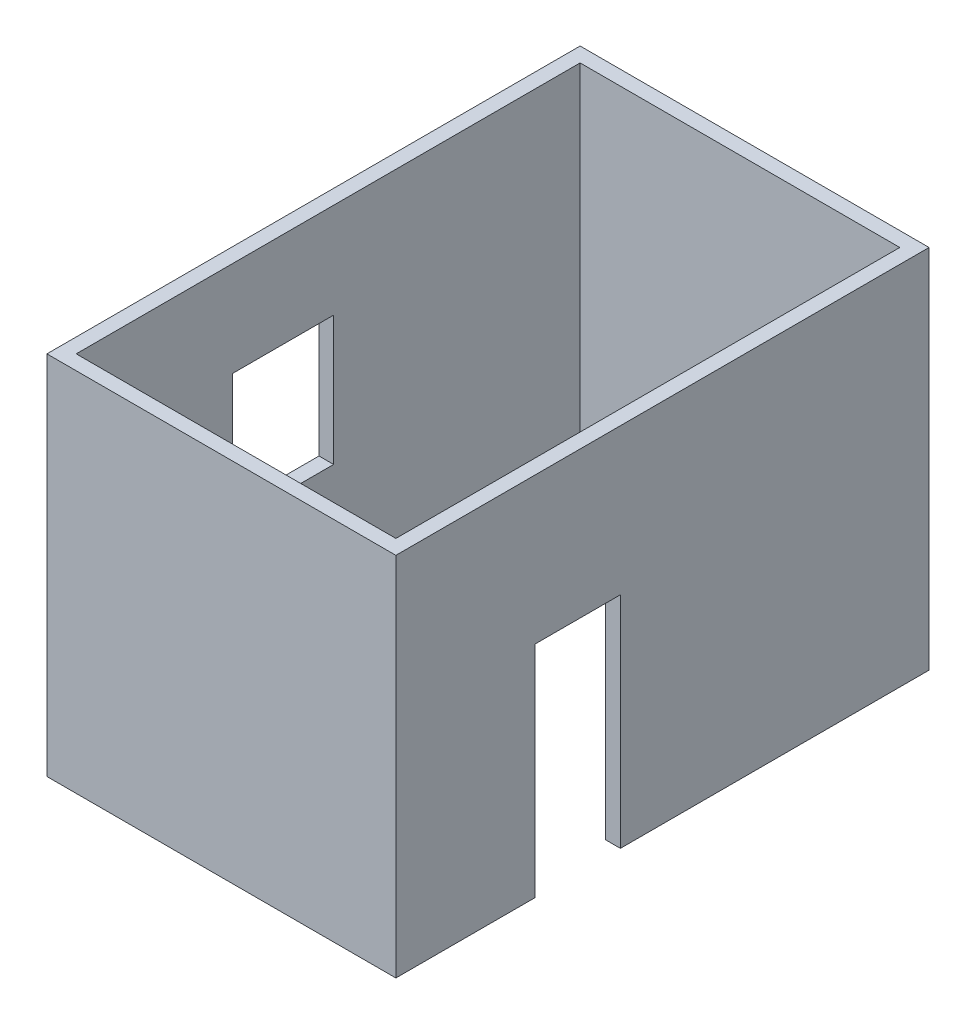
ISO-10303-21;
HEADER;
FILE_DESCRIPTION(('STEP AP214'),'2;1');
FILE_NAME('part.step','',(''),(''),'','','');
FILE_SCHEMA(('AUTOMOTIVE_DESIGN { 1 0 10303 214 1 1 1 1 }'));
ENDSEC;
DATA;
#1=APPLICATION_CONTEXT('core data for automotive mechanical design processes');
#2=APPLICATION_PROTOCOL_DEFINITION('international standard','automotive_design',2000,#1);
#3=PRODUCT_CONTEXT('',#1,'mechanical');
#4=PRODUCT('Part','Part','',(#3));
#5=PRODUCT_RELATED_PRODUCT_CATEGORY('part','',(#4));
#6=PRODUCT_DEFINITION_FORMATION('','',#4);
#7=PRODUCT_DEFINITION_CONTEXT('part definition',#1,'design');
#8=PRODUCT_DEFINITION('design','',#6,#7);
#9=PRODUCT_DEFINITION_SHAPE('','',#8);
#10=(LENGTH_UNIT() NAMED_UNIT(*) SI_UNIT(.MILLI.,.METRE.));
#11=(NAMED_UNIT(*) PLANE_ANGLE_UNIT() SI_UNIT($,.RADIAN.));
#12=(NAMED_UNIT(*) SI_UNIT($,.STERADIAN.) SOLID_ANGLE_UNIT());
#13=UNCERTAINTY_MEASURE_WITH_UNIT(LENGTH_MEASURE(1.E-05),#10,'distance_accuracy_value','');
#14=(GEOMETRIC_REPRESENTATION_CONTEXT(3) GLOBAL_UNCERTAINTY_ASSIGNED_CONTEXT((#13)) GLOBAL_UNIT_ASSIGNED_CONTEXT((#10,
#11,#12)) REPRESENTATION_CONTEXT('',''));
#15=CARTESIAN_POINT('',(0.,0.,0.));
#16=DIRECTION('',(0.,0.,1.));
#17=DIRECTION('',(1.,0.,0.));
#18=AXIS2_PLACEMENT_3D('',#15,#16,#17);
#19=CARTESIAN_POINT('',(0.,3000.,0.));
#20=DIRECTION('',(0.,1.,0.));
#21=DIRECTION('',(0.,0.,1.));
#22=AXIS2_PLACEMENT_3D('',#19,#20,#21);
#23=PLANE('',#22);
#24=DIRECTION('',(0.,0.,-1.));
#25=VECTOR('',#24,1.);
#26=CARTESIAN_POINT('',(120.,3000.,0.));
#27=LINE('',#26,#25);
#28=CARTESIAN_POINT('',(120.,3000.,120.));
#29=VERTEX_POINT('',#28);
#30=CARTESIAN_POINT('',(120.,3000.,-4250.));
#31=VERTEX_POINT('',#30);
#32=EDGE_CURVE('E267',#29,#31,#27,.T.);
#33=ORIENTED_EDGE('',*,*,#32,.T.);
#34=DIRECTION('',(-1.,0.,0.));
#35=VECTOR('',#34,1.);
#36=CARTESIAN_POINT('',(0.,3000.,-4250.));
#37=LINE('',#36,#35);
#38=CARTESIAN_POINT('',(-2740.,3000.,-4250.));
#39=VERTEX_POINT('',#38);
#40=EDGE_CURVE('E270',#31,#39,#37,.T.);
#41=ORIENTED_EDGE('',*,*,#40,.T.);
#42=DIRECTION('',(0.,0.,1.));
#43=VECTOR('',#42,1.);
#44=CARTESIAN_POINT('',(-2740.,3000.,3.20857461376607E-13));
#45=LINE('',#44,#43);
#46=CARTESIAN_POINT('',(-2740.,3000.,120.));
#47=VERTEX_POINT('',#46);
#48=EDGE_CURVE('E273',#39,#47,#45,.T.);
#49=ORIENTED_EDGE('',*,*,#48,.T.);
#50=DIRECTION('',(1.,0.,0.));
#51=VECTOR('',#50,1.);
#52=CARTESIAN_POINT('',(0.,3000.,120.));
#53=LINE('',#52,#51);
#54=EDGE_CURVE('E275',#47,#29,#53,.T.);
#55=ORIENTED_EDGE('',*,*,#54,.T.);
#56=EDGE_LOOP('',(#33,#41,#49,#55));
#57=FACE_BOUND('',#56,.T.);
#58=DIRECTION('',(-1.,0.,0.));
#59=VECTOR('',#58,1.);
#60=CARTESIAN_POINT('',(0.,3000.,-4130.));
#61=LINE('',#60,#59);
#62=CARTESIAN_POINT('',(0.,3000.,-4130.));
#63=VERTEX_POINT('',#62);
#64=CARTESIAN_POINT('',(-2620.,3000.,-4130.));
#65=VERTEX_POINT('',#64);
#66=EDGE_CURVE('E237',#63,#65,#61,.T.);
#67=ORIENTED_EDGE('',*,*,#66,.F.);
#68=DIRECTION('',(0.,0.,-1.));
#69=VECTOR('',#68,1.);
#70=CARTESIAN_POINT('',(0.,3000.,0.));
#71=LINE('',#70,#69);
#72=CARTESIAN_POINT('',(0.,3000.,0.));
#73=VERTEX_POINT('',#72);
#74=EDGE_CURVE('E235',#73,#63,#71,.T.);
#75=ORIENTED_EDGE('',*,*,#74,.F.);
#76=DIRECTION('',(1.,0.,0.));
#77=VECTOR('',#76,1.);
#78=CARTESIAN_POINT('',(0.,3000.,0.));
#79=LINE('',#78,#77);
#80=CARTESIAN_POINT('',(-2620.,3000.,3.20857461376606E-13));
#81=VERTEX_POINT('',#80);
#82=EDGE_CURVE('E243',#81,#73,#79,.T.);
#83=ORIENTED_EDGE('',*,*,#82,.F.);
#84=DIRECTION('',(0.,0.,1.));
#85=VECTOR('',#84,1.);
#86=CARTESIAN_POINT('',(-2620.,3000.,3.20857461376607E-13));
#87=LINE('',#86,#85);
#88=EDGE_CURVE('E240',#65,#81,#87,.T.);
#89=ORIENTED_EDGE('',*,*,#88,.F.);
#90=EDGE_LOOP('',(#67,#75,#83,#89));
#91=FACE_BOUND('',#90,.T.);
#92=ADVANCED_FACE('F59',(#57,#91),#23,.T.);
#93=CARTESIAN_POINT('',(0.,0.,0.));
#94=DIRECTION('',(0.,1.,0.));
#95=DIRECTION('',(0.,0.,1.));
#96=AXIS2_PLACEMENT_3D('',#93,#94,#95);
#97=PLANE('',#96);
#98=DIRECTION('',(0.,0.,-1.));
#99=VECTOR('',#98,1.);
#100=CARTESIAN_POINT('',(0.,0.,0.));
#101=LINE('',#100,#99);
#102=CARTESIAN_POINT('',(0.,0.,0.));
#103=VERTEX_POINT('',#102);
#104=CARTESIAN_POINT('',(0.,0.,-1020.));
#105=VERTEX_POINT('',#104);
#106=EDGE_CURVE('E246',#103,#105,#101,.T.);
#107=ORIENTED_EDGE('',*,*,#106,.T.);
#108=DIRECTION('',(1.,0.,0.));
#109=VECTOR('',#108,1.);
#110=CARTESIAN_POINT('',(-2740.001,0.,-1020.));
#111=LINE('',#110,#109);
#112=CARTESIAN_POINT('',(120.,0.,-1020.));
#113=VERTEX_POINT('',#112);
#114=EDGE_CURVE('E221',#105,#113,#111,.T.);
#115=ORIENTED_EDGE('',*,*,#114,.T.);
#116=DIRECTION('',(0.,0.,-1.));
#117=VECTOR('',#116,1.);
#118=CARTESIAN_POINT('',(120.,0.,0.));
#119=LINE('',#118,#117);
#120=CARTESIAN_POINT('',(120.,0.,120.));
#121=VERTEX_POINT('',#120);
#122=EDGE_CURVE('E278',#121,#113,#119,.T.);
#123=ORIENTED_EDGE('',*,*,#122,.F.);
#124=DIRECTION('',(1.,0.,0.));
#125=VECTOR('',#124,1.);
#126=CARTESIAN_POINT('',(0.,0.,120.));
#127=LINE('',#126,#125);
#128=CARTESIAN_POINT('',(-2740.,0.,120.));
#129=VERTEX_POINT('',#128);
#130=EDGE_CURVE('E271',#129,#121,#127,.T.);
#131=ORIENTED_EDGE('',*,*,#130,.F.);
#132=DIRECTION('',(0.,0.,1.));
#133=VECTOR('',#132,1.);
#134=CARTESIAN_POINT('',(-2740.,0.,3.20857461376607E-13));
#135=LINE('',#134,#133);
#136=CARTESIAN_POINT('',(-2740.,0.,-4250.));
#137=VERTEX_POINT('',#136);
#138=EDGE_CURVE('E283',#137,#129,#135,.T.);
#139=ORIENTED_EDGE('',*,*,#138,.F.);
#140=DIRECTION('',(-1.,0.,0.));
#141=VECTOR('',#140,1.);
#142=CARTESIAN_POINT('',(0.,0.,-4250.));
#143=LINE('',#142,#141);
#144=CARTESIAN_POINT('',(120.,0.,-4250.));
#145=VERTEX_POINT('',#144);
#146=EDGE_CURVE('E281',#145,#137,#143,.T.);
#147=ORIENTED_EDGE('',*,*,#146,.F.);
#148=CARTESIAN_POINT('',(120.,0.,-1720.));
#149=VERTEX_POINT('',#148);
#150=EDGE_CURVE('E266',#149,#145,#119,.T.);
#151=ORIENTED_EDGE('',*,*,#150,.F.);
#152=DIRECTION('',(1.,0.,0.));
#153=VECTOR('',#152,1.);
#154=CARTESIAN_POINT('',(-2740.001,0.,-1720.));
#155=LINE('',#154,#153);
#156=CARTESIAN_POINT('',(0.,0.,-1720.));
#157=VERTEX_POINT('',#156);
#158=EDGE_CURVE('E218',#157,#149,#155,.T.);
#159=ORIENTED_EDGE('',*,*,#158,.F.);
#160=CARTESIAN_POINT('',(0.,0.,-4130.));
#161=VERTEX_POINT('',#160);
#162=EDGE_CURVE('E212',#157,#161,#101,.T.);
#163=ORIENTED_EDGE('',*,*,#162,.T.);
#164=DIRECTION('',(-1.,0.,0.));
#165=VECTOR('',#164,1.);
#166=CARTESIAN_POINT('',(0.,0.,-4130.));
#167=LINE('',#166,#165);
#168=CARTESIAN_POINT('',(-2620.,0.,-4130.));
#169=VERTEX_POINT('',#168);
#170=EDGE_CURVE('E249',#161,#169,#167,.T.);
#171=ORIENTED_EDGE('',*,*,#170,.T.);
#172=DIRECTION('',(0.,0.,1.));
#173=VECTOR('',#172,1.);
#174=CARTESIAN_POINT('',(-2620.,0.,3.20857461376607E-13));
#175=LINE('',#174,#173);
#176=CARTESIAN_POINT('',(-2620.,0.,3.20857461376607E-13));
#177=VERTEX_POINT('',#176);
#178=EDGE_CURVE('E252',#169,#177,#175,.T.);
#179=ORIENTED_EDGE('',*,*,#178,.T.);
#180=DIRECTION('',(1.,0.,0.));
#181=VECTOR('',#180,1.);
#182=CARTESIAN_POINT('',(0.,0.,0.));
#183=LINE('',#182,#181);
#184=EDGE_CURVE('E238',#177,#103,#183,.T.);
#185=ORIENTED_EDGE('',*,*,#184,.T.);
#186=EDGE_LOOP('',(#107,#115,#123,#131,#139,#147,#151,#159,#163,#171,#179,#185));
#187=FACE_BOUND('',#186,.T.);
#188=ADVANCED_FACE('F299',(#187),#97,.F.);
#189=CARTESIAN_POINT('',(120.,3000.,0.));
#190=DIRECTION('',(-1.,0.,0.));
#191=DIRECTION('',(0.,0.,1.));
#192=AXIS2_PLACEMENT_3D('',#189,#190,#191);
#193=PLANE('',#192);
#194=ORIENTED_EDGE('',*,*,#122,.T.);
#195=DIRECTION('',(0.,-1.,0.));
#196=VECTOR('',#195,1.);
#197=CARTESIAN_POINT('',(120.,0.,-1020.));
#198=LINE('',#197,#196);
#199=CARTESIAN_POINT('',(120.,1800.,-1020.));
#200=VERTEX_POINT('',#199);
#201=EDGE_CURVE('E216',#200,#113,#198,.T.);
#202=ORIENTED_EDGE('',*,*,#201,.F.);
#203=DIRECTION('',(0.,0.,1.));
#204=VECTOR('',#203,1.);
#205=CARTESIAN_POINT('',(120.,1800.,-1020.));
#206=LINE('',#205,#204);
#207=CARTESIAN_POINT('',(120.,1800.,-1720.));
#208=VERTEX_POINT('',#207);
#209=EDGE_CURVE('E209',#208,#200,#206,.T.);
#210=ORIENTED_EDGE('',*,*,#209,.F.);
#211=DIRECTION('',(0.,1.,0.));
#212=VECTOR('',#211,1.);
#213=CARTESIAN_POINT('',(120.,0.,-1720.));
#214=LINE('',#213,#212);
#215=EDGE_CURVE('E213',#149,#208,#214,.T.);
#216=ORIENTED_EDGE('',*,*,#215,.F.);
#217=ORIENTED_EDGE('',*,*,#150,.T.);
#218=DIRECTION('',(0.,-1.,0.));
#219=VECTOR('',#218,1.);
#220=CARTESIAN_POINT('',(120.,3000.,-4250.));
#221=LINE('',#220,#219);
#222=EDGE_CURVE('E12',#31,#145,#221,.T.);
#223=ORIENTED_EDGE('',*,*,#222,.F.);
#224=ORIENTED_EDGE('',*,*,#32,.F.);
#225=DIRECTION('',(0.,-1.,0.));
#226=VECTOR('',#225,1.);
#227=CARTESIAN_POINT('',(120.,3000.,120.));
#228=LINE('',#227,#226);
#229=EDGE_CURVE('E277',#29,#121,#228,.T.);
#230=ORIENTED_EDGE('',*,*,#229,.T.);
#231=EDGE_LOOP('',(#194,#202,#210,#216,#217,#223,#224,#230));
#232=FACE_BOUND('',#231,.T.);
#233=ADVANCED_FACE('F61',(#232),#193,.F.);
#234=CARTESIAN_POINT('',(0.,3000.,-4250.));
#235=DIRECTION('',(0.,0.,1.));
#236=DIRECTION('',(1.,0.,0.));
#237=AXIS2_PLACEMENT_3D('',#234,#235,#236);
#238=PLANE('',#237);
#239=ORIENTED_EDGE('',*,*,#146,.T.);
#240=DIRECTION('',(0.,-1.,0.));
#241=VECTOR('',#240,1.);
#242=CARTESIAN_POINT('',(-2740.,3000.,-4250.));
#243=LINE('',#242,#241);
#244=EDGE_CURVE('E67',#39,#137,#243,.T.);
#245=ORIENTED_EDGE('',*,*,#244,.F.);
#246=ORIENTED_EDGE('',*,*,#40,.F.);
#247=ORIENTED_EDGE('',*,*,#222,.T.);
#248=EDGE_LOOP('',(#239,#245,#246,#247));
#249=FACE_BOUND('',#248,.T.);
#250=ADVANCED_FACE('F312',(#249),#238,.F.);
#251=CARTESIAN_POINT('',(-2740.,3000.,3.20857461376607E-13));
#252=DIRECTION('',(1.,0.,0.));
#253=DIRECTION('',(0.,0.,-1.));
#254=AXIS2_PLACEMENT_3D('',#251,#252,#253);
#255=PLANE('',#254);
#256=DIRECTION('',(0.,0.,-1.));
#257=VECTOR('',#256,1.);
#258=CARTESIAN_POINT('',(-2740.,2220.,-1280.));
#259=LINE('',#258,#257);
#260=CARTESIAN_POINT('',(-2740.,2220.,-1280.));
#261=VERTEX_POINT('',#260);
#262=CARTESIAN_POINT('',(-2740.,2220.,-2110.));
#263=VERTEX_POINT('',#262);
#264=EDGE_CURVE('E192',#261,#263,#259,.T.);
#265=ORIENTED_EDGE('',*,*,#264,.F.);
#266=DIRECTION('',(0.,1.,0.));
#267=VECTOR('',#266,1.);
#268=CARTESIAN_POINT('',(-2740.,2220.,-1280.));
#269=LINE('',#268,#267);
#270=CARTESIAN_POINT('',(-2740.,1160.,-1280.));
#271=VERTEX_POINT('',#270);
#272=EDGE_CURVE('E174',#271,#261,#269,.T.);
#273=ORIENTED_EDGE('',*,*,#272,.F.);
#274=DIRECTION('',(0.,0.,1.));
#275=VECTOR('',#274,1.);
#276=CARTESIAN_POINT('',(-2740.,1160.,-1280.));
#277=LINE('',#276,#275);
#278=CARTESIAN_POINT('',(-2740.,1160.,-2110.));
#279=VERTEX_POINT('',#278);
#280=EDGE_CURVE('E183',#279,#271,#277,.T.);
#281=ORIENTED_EDGE('',*,*,#280,.F.);
#282=DIRECTION('',(0.,-1.,0.));
#283=VECTOR('',#282,1.);
#284=CARTESIAN_POINT('',(-2740.,2220.,-2110.));
#285=LINE('',#284,#283);
#286=EDGE_CURVE('E74',#263,#279,#285,.T.);
#287=ORIENTED_EDGE('',*,*,#286,.F.);
#288=EDGE_LOOP('',(#265,#273,#281,#287));
#289=FACE_BOUND('',#288,.T.);
#290=ORIENTED_EDGE('',*,*,#138,.T.);
#291=DIRECTION('',(0.,-1.,0.));
#292=VECTOR('',#291,1.);
#293=CARTESIAN_POINT('',(-2740.,3000.,120.));
#294=LINE('',#293,#292);
#295=EDGE_CURVE('E288',#47,#129,#294,.T.);
#296=ORIENTED_EDGE('',*,*,#295,.F.);
#297=ORIENTED_EDGE('',*,*,#48,.F.);
#298=ORIENTED_EDGE('',*,*,#244,.T.);
#299=EDGE_LOOP('',(#290,#296,#297,#298));
#300=FACE_BOUND('',#299,.T.);
#301=ADVANCED_FACE('F189',(#289,#300),#255,.F.);
#302=CARTESIAN_POINT('',(0.,3000.,120.));
#303=DIRECTION('',(0.,0.,-1.));
#304=DIRECTION('',(-1.,0.,0.));
#305=AXIS2_PLACEMENT_3D('',#302,#303,#304);
#306=PLANE('',#305);
#307=ORIENTED_EDGE('',*,*,#130,.T.);
#308=ORIENTED_EDGE('',*,*,#229,.F.);
#309=ORIENTED_EDGE('',*,*,#54,.F.);
#310=ORIENTED_EDGE('',*,*,#295,.T.);
#311=EDGE_LOOP('',(#307,#308,#309,#310));
#312=FACE_BOUND('',#311,.T.);
#313=ADVANCED_FACE('F304',(#312),#306,.F.);
#314=CARTESIAN_POINT('',(0.,3000.,0.));
#315=DIRECTION('',(-1.,0.,0.));
#316=DIRECTION('',(0.,0.,1.));
#317=AXIS2_PLACEMENT_3D('',#314,#315,#316);
#318=PLANE('',#317);
#319=DIRECTION('',(0.,-1.,0.));
#320=VECTOR('',#319,1.);
#321=CARTESIAN_POINT('',(0.,0.,-1020.));
#322=LINE('',#321,#320);
#323=CARTESIAN_POINT('',(0.,1800.,-1020.));
#324=VERTEX_POINT('',#323);
#325=EDGE_CURVE('E186',#324,#105,#322,.T.);
#326=ORIENTED_EDGE('',*,*,#325,.T.);
#327=ORIENTED_EDGE('',*,*,#106,.F.);
#328=DIRECTION('',(0.,-1.,0.));
#329=VECTOR('',#328,1.);
#330=CARTESIAN_POINT('',(0.,3000.,0.));
#331=LINE('',#330,#329);
#332=EDGE_CURVE('E245',#73,#103,#331,.T.);
#333=ORIENTED_EDGE('',*,*,#332,.F.);
#334=ORIENTED_EDGE('',*,*,#74,.T.);
#335=DIRECTION('',(0.,-1.,0.));
#336=VECTOR('',#335,1.);
#337=CARTESIAN_POINT('',(0.,3000.,-4130.));
#338=LINE('',#337,#336);
#339=EDGE_CURVE('E263',#63,#161,#338,.T.);
#340=ORIENTED_EDGE('',*,*,#339,.T.);
#341=ORIENTED_EDGE('',*,*,#162,.F.);
#342=DIRECTION('',(0.,1.,0.));
#343=VECTOR('',#342,1.);
#344=CARTESIAN_POINT('',(0.,0.,-1720.));
#345=LINE('',#344,#343);
#346=CARTESIAN_POINT('',(0.,1800.,-1720.));
#347=VERTEX_POINT('',#346);
#348=EDGE_CURVE('E226',#157,#347,#345,.T.);
#349=ORIENTED_EDGE('',*,*,#348,.T.);
#350=DIRECTION('',(0.,0.,1.));
#351=VECTOR('',#350,1.);
#352=CARTESIAN_POINT('',(0.,1800.,-1020.));
#353=LINE('',#352,#351);
#354=EDGE_CURVE('E222',#347,#324,#353,.T.);
#355=ORIENTED_EDGE('',*,*,#354,.T.);
#356=EDGE_LOOP('',(#326,#327,#333,#334,#340,#341,#349,#355));
#357=FACE_BOUND('',#356,.T.);
#358=ADVANCED_FACE('F326',(#357),#318,.T.);
#359=CARTESIAN_POINT('',(0.,3000.,-4130.));
#360=DIRECTION('',(0.,0.,1.));
#361=DIRECTION('',(1.,0.,0.));
#362=AXIS2_PLACEMENT_3D('',#359,#360,#361);
#363=PLANE('',#362);
#364=ORIENTED_EDGE('',*,*,#170,.F.);
#365=ORIENTED_EDGE('',*,*,#339,.F.);
#366=ORIENTED_EDGE('',*,*,#66,.T.);
#367=DIRECTION('',(0.,-1.,0.));
#368=VECTOR('',#367,1.);
#369=CARTESIAN_POINT('',(-2620.,3000.,-4130.));
#370=LINE('',#369,#368);
#371=EDGE_CURVE('E261',#65,#169,#370,.T.);
#372=ORIENTED_EDGE('',*,*,#371,.T.);
#373=EDGE_LOOP('',(#364,#365,#366,#372));
#374=FACE_BOUND('',#373,.T.);
#375=ADVANCED_FACE('F333',(#374),#363,.T.);
#376=CARTESIAN_POINT('',(-2620.,3000.,3.20857461376607E-13));
#377=DIRECTION('',(1.,0.,0.));
#378=DIRECTION('',(0.,0.,-1.));
#379=AXIS2_PLACEMENT_3D('',#376,#377,#378);
#380=PLANE('',#379);
#381=DIRECTION('',(0.,-1.,0.));
#382=VECTOR('',#381,1.);
#383=CARTESIAN_POINT('',(-2620.,2220.,-1280.));
#384=LINE('',#383,#382);
#385=CARTESIAN_POINT('',(-2620.,2220.,-1280.));
#386=VERTEX_POINT('',#385);
#387=CARTESIAN_POINT('',(-2620.,1160.,-1280.));
#388=VERTEX_POINT('',#387);
#389=EDGE_CURVE('E82',#386,#388,#384,.T.);
#390=ORIENTED_EDGE('',*,*,#389,.F.);
#391=DIRECTION('',(0.,0.,1.));
#392=VECTOR('',#391,1.);
#393=CARTESIAN_POINT('',(-2620.,2220.,-1280.));
#394=LINE('',#393,#392);
#395=CARTESIAN_POINT('',(-2620.,2220.,-2110.));
#396=VERTEX_POINT('',#395);
#397=EDGE_CURVE('E180',#396,#386,#394,.T.);
#398=ORIENTED_EDGE('',*,*,#397,.F.);
#399=DIRECTION('',(0.,1.,0.));
#400=VECTOR('',#399,1.);
#401=CARTESIAN_POINT('',(-2620.,2220.,-2110.));
#402=LINE('',#401,#400);
#403=CARTESIAN_POINT('',(-2620.,1160.,-2110.));
#404=VERTEX_POINT('',#403);
#405=EDGE_CURVE('E200',#404,#396,#402,.T.);
#406=ORIENTED_EDGE('',*,*,#405,.F.);
#407=DIRECTION('',(0.,0.,-1.));
#408=VECTOR('',#407,1.);
#409=CARTESIAN_POINT('',(-2620.,1160.,-1280.));
#410=LINE('',#409,#408);
#411=EDGE_CURVE('E194',#388,#404,#410,.T.);
#412=ORIENTED_EDGE('',*,*,#411,.F.);
#413=EDGE_LOOP('',(#390,#398,#406,#412));
#414=FACE_BOUND('',#413,.T.);
#415=ORIENTED_EDGE('',*,*,#178,.F.);
#416=ORIENTED_EDGE('',*,*,#371,.F.);
#417=ORIENTED_EDGE('',*,*,#88,.T.);
#418=DIRECTION('',(0.,-1.,0.));
#419=VECTOR('',#418,1.);
#420=CARTESIAN_POINT('',(-2620.,3000.,3.20857461376607E-13));
#421=LINE('',#420,#419);
#422=EDGE_CURVE('E259',#81,#177,#421,.T.);
#423=ORIENTED_EDGE('',*,*,#422,.T.);
#424=EDGE_LOOP('',(#415,#416,#417,#423));
#425=FACE_BOUND('',#424,.T.);
#426=ADVANCED_FACE('F338',(#414,#425),#380,.T.);
#427=CARTESIAN_POINT('',(0.,3000.,0.));
#428=DIRECTION('',(0.,0.,-1.));
#429=DIRECTION('',(-1.,0.,0.));
#430=AXIS2_PLACEMENT_3D('',#427,#428,#429);
#431=PLANE('',#430);
#432=ORIENTED_EDGE('',*,*,#184,.F.);
#433=ORIENTED_EDGE('',*,*,#422,.F.);
#434=ORIENTED_EDGE('',*,*,#82,.T.);
#435=ORIENTED_EDGE('',*,*,#332,.T.);
#436=EDGE_LOOP('',(#432,#433,#434,#435));
#437=FACE_BOUND('',#436,.T.);
#438=ADVANCED_FACE('F347',(#437),#431,.T.);
#439=CARTESIAN_POINT('',(-2740.001,0.,-1020.));
#440=DIRECTION('',(0.,0.,1.));
#441=DIRECTION('',(1.,0.,0.));
#442=AXIS2_PLACEMENT_3D('',#439,#440,#441);
#443=PLANE('',#442);
#444=DIRECTION('',(1.,0.,0.));
#445=VECTOR('',#444,1.);
#446=CARTESIAN_POINT('',(-2740.001,1800.,-1020.));
#447=LINE('',#446,#445);
#448=EDGE_CURVE('E225',#324,#200,#447,.T.);
#449=ORIENTED_EDGE('',*,*,#448,.T.);
#450=ORIENTED_EDGE('',*,*,#201,.T.);
#451=ORIENTED_EDGE('',*,*,#114,.F.);
#452=ORIENTED_EDGE('',*,*,#325,.F.);
#453=EDGE_LOOP('',(#449,#450,#451,#452));
#454=FACE_BOUND('',#453,.T.);
#455=ADVANCED_FACE('F364',(#454),#443,.F.);
#456=CARTESIAN_POINT('',(-2740.001,1800.,-1020.));
#457=DIRECTION('',(0.,1.,0.));
#458=DIRECTION('',(0.,0.,1.));
#459=AXIS2_PLACEMENT_3D('',#456,#457,#458);
#460=PLANE('',#459);
#461=DIRECTION('',(1.,0.,0.));
#462=VECTOR('',#461,1.);
#463=CARTESIAN_POINT('',(-2740.001,1800.,-1720.));
#464=LINE('',#463,#462);
#465=EDGE_CURVE('E229',#347,#208,#464,.T.);
#466=ORIENTED_EDGE('',*,*,#465,.T.);
#467=ORIENTED_EDGE('',*,*,#209,.T.);
#468=ORIENTED_EDGE('',*,*,#448,.F.);
#469=ORIENTED_EDGE('',*,*,#354,.F.);
#470=EDGE_LOOP('',(#466,#467,#468,#469));
#471=FACE_BOUND('',#470,.T.);
#472=ADVANCED_FACE('F363',(#471),#460,.F.);
#473=CARTESIAN_POINT('',(-2740.001,0.,-1720.));
#474=DIRECTION('',(0.,0.,-1.));
#475=DIRECTION('',(-1.,0.,0.));
#476=AXIS2_PLACEMENT_3D('',#473,#474,#475);
#477=PLANE('',#476);
#478=ORIENTED_EDGE('',*,*,#158,.T.);
#479=ORIENTED_EDGE('',*,*,#215,.T.);
#480=ORIENTED_EDGE('',*,*,#465,.F.);
#481=ORIENTED_EDGE('',*,*,#348,.F.);
#482=EDGE_LOOP('',(#478,#479,#480,#481));
#483=FACE_BOUND('',#482,.T.);
#484=ADVANCED_FACE('F359',(#483),#477,.F.);
#485=CARTESIAN_POINT('',(-2740.001,2220.,-1280.));
#486=DIRECTION('',(0.,0.,1.));
#487=DIRECTION('',(0.,-1.,0.));
#488=AXIS2_PLACEMENT_3D('',#485,#486,#487);
#489=PLANE('',#488);
#490=ORIENTED_EDGE('',*,*,#272,.T.);
#491=DIRECTION('',(1.,0.,0.));
#492=VECTOR('',#491,1.);
#493=CARTESIAN_POINT('',(-2740.001,2220.,-1280.));
#494=LINE('',#493,#492);
#495=EDGE_CURVE('E187',#261,#386,#494,.T.);
#496=ORIENTED_EDGE('',*,*,#495,.T.);
#497=ORIENTED_EDGE('',*,*,#389,.T.);
#498=DIRECTION('',(1.,0.,0.));
#499=VECTOR('',#498,1.);
#500=CARTESIAN_POINT('',(-2740.001,1160.,-1280.));
#501=LINE('',#500,#499);
#502=EDGE_CURVE('E170',#271,#388,#501,.T.);
#503=ORIENTED_EDGE('',*,*,#502,.F.);
#504=EDGE_LOOP('',(#490,#496,#497,#503));
#505=FACE_BOUND('',#504,.T.);
#506=ADVANCED_FACE('F172',(#505),#489,.F.);
#507=CARTESIAN_POINT('',(-2740.001,2220.,-1280.));
#508=DIRECTION('',(0.,1.,0.));
#509=DIRECTION('',(0.,0.,1.));
#510=AXIS2_PLACEMENT_3D('',#507,#508,#509);
#511=PLANE('',#510);
#512=ORIENTED_EDGE('',*,*,#264,.T.);
#513=DIRECTION('',(1.,0.,0.));
#514=VECTOR('',#513,1.);
#515=CARTESIAN_POINT('',(-2740.001,2220.,-2110.));
#516=LINE('',#515,#514);
#517=EDGE_CURVE('E206',#263,#396,#516,.T.);
#518=ORIENTED_EDGE('',*,*,#517,.T.);
#519=ORIENTED_EDGE('',*,*,#397,.T.);
#520=ORIENTED_EDGE('',*,*,#495,.F.);
#521=EDGE_LOOP('',(#512,#518,#519,#520));
#522=FACE_BOUND('',#521,.T.);
#523=ADVANCED_FACE('F383',(#522),#511,.F.);
#524=CARTESIAN_POINT('',(-2740.001,2220.,-2110.));
#525=DIRECTION('',(0.,0.,-1.));
#526=DIRECTION('',(-1.,0.,0.));
#527=AXIS2_PLACEMENT_3D('',#524,#525,#526);
#528=PLANE('',#527);
#529=ORIENTED_EDGE('',*,*,#286,.T.);
#530=DIRECTION('',(1.,0.,0.));
#531=VECTOR('',#530,1.);
#532=CARTESIAN_POINT('',(-2740.001,1160.,-2110.));
#533=LINE('',#532,#531);
#534=EDGE_CURVE('E179',#279,#404,#533,.T.);
#535=ORIENTED_EDGE('',*,*,#534,.T.);
#536=ORIENTED_EDGE('',*,*,#405,.T.);
#537=ORIENTED_EDGE('',*,*,#517,.F.);
#538=EDGE_LOOP('',(#529,#535,#536,#537));
#539=FACE_BOUND('',#538,.T.);
#540=ADVANCED_FACE('F381',(#539),#528,.F.);
#541=CARTESIAN_POINT('',(-2740.001,1160.,-1280.));
#542=DIRECTION('',(0.,-1.,0.));
#543=DIRECTION('',(0.,0.,-1.));
#544=AXIS2_PLACEMENT_3D('',#541,#542,#543);
#545=PLANE('',#544);
#546=ORIENTED_EDGE('',*,*,#280,.T.);
#547=ORIENTED_EDGE('',*,*,#502,.T.);
#548=ORIENTED_EDGE('',*,*,#411,.T.);
#549=ORIENTED_EDGE('',*,*,#534,.F.);
#550=EDGE_LOOP('',(#546,#547,#548,#549));
#551=FACE_BOUND('',#550,.T.);
#552=ADVANCED_FACE('F184',(#551),#545,.F.);
#553=CLOSED_SHELL('',(#92,#188,#233,#250,#301,#313,#358,#375,#426,#438,#455,#472,#484,#506,#523,
#540,#552));
#554=MANIFOLD_SOLID_BREP('B2',#553);
#555=ADVANCED_BREP_SHAPE_REPRESENTATION('',(#18,#554),#14);
#556=SHAPE_DEFINITION_REPRESENTATION(#9,#555);
ENDSEC;
END-ISO-10303-21;
